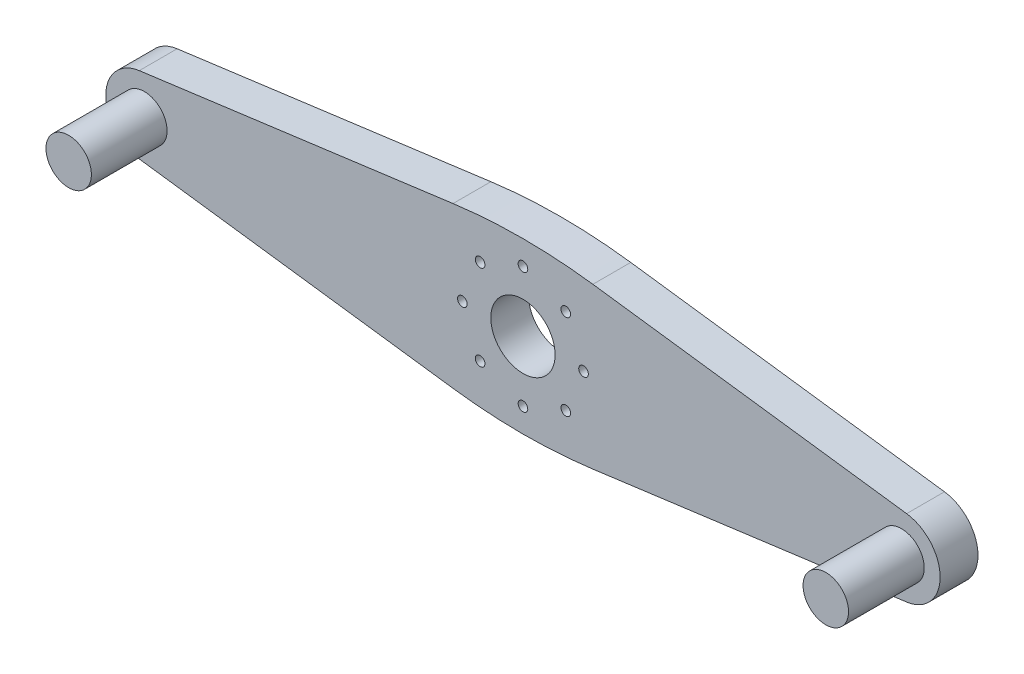
ISO-10303-21;
HEADER;
FILE_DESCRIPTION(('STEP AP214'),'2;1');
FILE_NAME('part.step','',(''),(''),'','','');
FILE_SCHEMA(('AUTOMOTIVE_DESIGN { 1 0 10303 214 1 1 1 1 }'));
ENDSEC;
DATA;
#1=APPLICATION_CONTEXT('core data for automotive mechanical design processes');
#2=APPLICATION_PROTOCOL_DEFINITION('international standard','automotive_design',2000,#1);
#3=PRODUCT_CONTEXT('',#1,'mechanical');
#4=PRODUCT('Part','Part','',(#3));
#5=PRODUCT_RELATED_PRODUCT_CATEGORY('part','',(#4));
#6=PRODUCT_DEFINITION_FORMATION('','',#4);
#7=PRODUCT_DEFINITION_CONTEXT('part definition',#1,'design');
#8=PRODUCT_DEFINITION('design','',#6,#7);
#9=PRODUCT_DEFINITION_SHAPE('','',#8);
#10=(LENGTH_UNIT() NAMED_UNIT(*) SI_UNIT(.MILLI.,.METRE.));
#11=(NAMED_UNIT(*) PLANE_ANGLE_UNIT() SI_UNIT($,.RADIAN.));
#12=(NAMED_UNIT(*) SI_UNIT($,.STERADIAN.) SOLID_ANGLE_UNIT());
#13=UNCERTAINTY_MEASURE_WITH_UNIT(LENGTH_MEASURE(1.E-05),#10,'distance_accuracy_value','');
#14=(GEOMETRIC_REPRESENTATION_CONTEXT(3) GLOBAL_UNCERTAINTY_ASSIGNED_CONTEXT((#13)) GLOBAL_UNIT_ASSIGNED_CONTEXT((#10,
#11,#12)) REPRESENTATION_CONTEXT('',''));
#15=CARTESIAN_POINT('',(0.,0.,0.));
#16=DIRECTION('',(0.,0.,1.));
#17=DIRECTION('',(1.,0.,0.));
#18=AXIS2_PLACEMENT_3D('',#15,#16,#17);
#19=CARTESIAN_POINT('',(50.,0.,5.));
#20=DIRECTION('',(0.,0.,-1.));
#21=DIRECTION('',(-1.,0.,0.));
#22=AXIS2_PLACEMENT_3D('',#19,#20,#21);
#23=PLANE('',#22);
#24=CARTESIAN_POINT('',(50.,0.,5.));
#25=DIRECTION('',(0.,0.,1.));
#26=DIRECTION('',(-1.,0.,0.));
#27=AXIS2_PLACEMENT_3D('',#24,#25,#26);
#28=CIRCLE('',#27,5.10024633771241);
#29=CARTESIAN_POINT('',(50.6728763500851,-5.05566515137672,5.));
#30=VERTEX_POINT('',#29);
#31=CARTESIAN_POINT('',(50.6728763500851,5.05566515137672,5.));
#32=VERTEX_POINT('',#31);
#33=EDGE_CURVE('E144',#30,#32,#28,.T.);
#34=ORIENTED_EDGE('',*,*,#33,.T.);
#35=DIRECTION('',(-0.991259013117456,0.131930166805804,0.));
#36=VECTOR('',#35,1.);
#37=CARTESIAN_POINT('',(50.6728763500851,5.05566515137672,5.));
#38=LINE('',#37,#36);
#39=CARTESIAN_POINT('',(9.2351116764065,10.5707637614413,5.));
#40=VERTEX_POINT('',#39);
#41=EDGE_CURVE('E92',#32,#40,#38,.T.);
#42=ORIENTED_EDGE('',*,*,#41,.T.);
#43=CARTESIAN_POINT('',(0.,-58.8173671567806,5.));
#44=DIRECTION('',(0.,0.,1.));
#45=DIRECTION('',(-1.,0.,0.));
#46=AXIS2_PLACEMENT_3D('',#43,#44,#45);
#47=CIRCLE('',#46,70.);
#48=CARTESIAN_POINT('',(-9.23511167640649,10.5707637614413,5.));
#49=VERTEX_POINT('',#48);
#50=EDGE_CURVE('E159',#40,#49,#47,.T.);
#51=ORIENTED_EDGE('',*,*,#50,.T.);
#52=DIRECTION('',(-0.991259013117456,-0.131930166805804,0.));
#53=VECTOR('',#52,1.);
#54=CARTESIAN_POINT('',(-50.6728763500851,5.05566515137672,5.));
#55=LINE('',#54,#53);
#56=CARTESIAN_POINT('',(-50.6728763500851,5.05566515137672,5.));
#57=VERTEX_POINT('',#56);
#58=EDGE_CURVE('E172',#49,#57,#55,.T.);
#59=ORIENTED_EDGE('',*,*,#58,.T.);
#60=CARTESIAN_POINT('',(-50.,0.,5.));
#61=DIRECTION('',(0.,0.,1.));
#62=DIRECTION('',(1.,0.,0.));
#63=AXIS2_PLACEMENT_3D('',#60,#61,#62);
#64=CIRCLE('',#63,5.10024633771241);
#65=CARTESIAN_POINT('',(-50.6728763500851,-5.05566515137672,5.));
#66=VERTEX_POINT('',#65);
#67=EDGE_CURVE('E111',#57,#66,#64,.T.);
#68=ORIENTED_EDGE('',*,*,#67,.T.);
#69=DIRECTION('',(0.991259013117456,-0.131930166805804,0.));
#70=VECTOR('',#69,1.);
#71=CARTESIAN_POINT('',(-50.6728763500851,-5.05566515137672,5.));
#72=LINE('',#71,#70);
#73=CARTESIAN_POINT('',(-9.23511167640653,-10.5707637614413,5.));
#74=VERTEX_POINT('',#73);
#75=EDGE_CURVE('E105',#66,#74,#72,.T.);
#76=ORIENTED_EDGE('',*,*,#75,.T.);
#77=CARTESIAN_POINT('',(0.,58.8173671567806,5.));
#78=DIRECTION('',(0.,0.,1.));
#79=DIRECTION('',(1.,0.,0.));
#80=AXIS2_PLACEMENT_3D('',#77,#78,#79);
#81=CIRCLE('',#80,70.);
#82=CARTESIAN_POINT('',(9.23511167640649,-10.5707637614413,5.));
#83=VERTEX_POINT('',#82);
#84=EDGE_CURVE('E109',#74,#83,#81,.T.);
#85=ORIENTED_EDGE('',*,*,#84,.T.);
#86=DIRECTION('',(0.991259013117456,0.131930166805804,0.));
#87=VECTOR('',#86,1.);
#88=CARTESIAN_POINT('',(50.6728763500851,-5.05566515137672,5.));
#89=LINE('',#88,#87);
#90=EDGE_CURVE('E49',#83,#30,#89,.T.);
#91=ORIENTED_EDGE('',*,*,#90,.T.);
#92=EDGE_LOOP('',(#34,#42,#51,#59,#68,#76,#85,#91));
#93=FACE_BOUND('',#92,.T.);
#94=CARTESIAN_POINT('',(0.,0.,5.));
#95=DIRECTION('',(0.,0.,1.));
#96=DIRECTION('',(1.,0.,0.));
#97=AXIS2_PLACEMENT_3D('',#94,#95,#96);
#98=CIRCLE('',#97,4.25);
#99=CARTESIAN_POINT('',(4.25,0.,5.));
#100=VERTEX_POINT('',#99);
#101=EDGE_CURVE('E133',#100,#100,#98,.T.);
#102=ORIENTED_EDGE('',*,*,#101,.F.);
#103=EDGE_LOOP('',(#102));
#104=FACE_BOUND('',#103,.T.);
#105=CARTESIAN_POINT('',(-8.,0.,5.));
#106=DIRECTION('',(0.,0.,1.));
#107=DIRECTION('',(1.,0.,0.));
#108=AXIS2_PLACEMENT_3D('',#105,#106,#107);
#109=CIRCLE('',#108,0.635000000000001);
#110=CARTESIAN_POINT('',(-7.365,0.,5.));
#111=VERTEX_POINT('',#110);
#112=EDGE_CURVE('E181',#111,#111,#109,.T.);
#113=ORIENTED_EDGE('',*,*,#112,.F.);
#114=EDGE_LOOP('',(#113));
#115=FACE_BOUND('',#114,.T.);
#116=CARTESIAN_POINT('',(-50.,0.,5.));
#117=DIRECTION('',(0.,0.,1.));
#118=DIRECTION('',(1.,0.,0.));
#119=AXIS2_PLACEMENT_3D('',#116,#117,#118);
#120=CIRCLE('',#119,3.);
#121=CARTESIAN_POINT('',(-47.,0.,5.));
#122=VERTEX_POINT('',#121);
#123=EDGE_CURVE('E187',#122,#122,#120,.T.);
#124=ORIENTED_EDGE('',*,*,#123,.F.);
#125=EDGE_LOOP('',(#124));
#126=FACE_BOUND('',#125,.T.);
#127=CARTESIAN_POINT('',(-5.65685424949237,5.65685424949239,5.));
#128=DIRECTION('',(0.,0.,1.));
#129=DIRECTION('',(1.,0.,0.));
#130=AXIS2_PLACEMENT_3D('',#127,#128,#129);
#131=CIRCLE('',#130,0.635000000000001);
#132=CARTESIAN_POINT('',(-5.02185424949237,5.65685424949239,5.));
#133=VERTEX_POINT('',#132);
#134=EDGE_CURVE('E192',#133,#133,#131,.T.);
#135=ORIENTED_EDGE('',*,*,#134,.F.);
#136=EDGE_LOOP('',(#135));
#137=FACE_BOUND('',#136,.T.);
#138=CARTESIAN_POINT('',(0.,8.,5.));
#139=DIRECTION('',(0.,0.,1.));
#140=DIRECTION('',(1.,0.,0.));
#141=AXIS2_PLACEMENT_3D('',#138,#139,#140);
#142=CIRCLE('',#141,0.635000000000001);
#143=CARTESIAN_POINT('',(0.63500000000003,8.,5.));
#144=VERTEX_POINT('',#143);
#145=EDGE_CURVE('E196',#144,#144,#142,.T.);
#146=ORIENTED_EDGE('',*,*,#145,.F.);
#147=EDGE_LOOP('',(#146));
#148=FACE_BOUND('',#147,.T.);
#149=CARTESIAN_POINT('',(50.,0.,5.));
#150=DIRECTION('',(0.,0.,1.));
#151=DIRECTION('',(-1.,0.,0.));
#152=AXIS2_PLACEMENT_3D('',#149,#150,#151);
#153=CIRCLE('',#152,3.);
#154=CARTESIAN_POINT('',(47.,0.,5.));
#155=VERTEX_POINT('',#154);
#156=EDGE_CURVE('E202',#155,#155,#153,.T.);
#157=ORIENTED_EDGE('',*,*,#156,.F.);
#158=EDGE_LOOP('',(#157));
#159=FACE_BOUND('',#158,.T.);
#160=CARTESIAN_POINT('',(5.65685424949241,5.65685424949235,5.));
#161=DIRECTION('',(0.,0.,1.));
#162=DIRECTION('',(1.,0.,0.));
#163=AXIS2_PLACEMENT_3D('',#160,#161,#162);
#164=CIRCLE('',#163,0.635);
#165=CARTESIAN_POINT('',(6.29185424949241,5.65685424949235,5.));
#166=VERTEX_POINT('',#165);
#167=EDGE_CURVE('E207',#166,#166,#164,.T.);
#168=ORIENTED_EDGE('',*,*,#167,.F.);
#169=EDGE_LOOP('',(#168));
#170=FACE_BOUND('',#169,.T.);
#171=CARTESIAN_POINT('',(8.,0.,5.));
#172=DIRECTION('',(0.,0.,1.));
#173=DIRECTION('',(1.,0.,0.));
#174=AXIS2_PLACEMENT_3D('',#171,#172,#173);
#175=CIRCLE('',#174,0.635);
#176=CARTESIAN_POINT('',(8.635,0.,5.));
#177=VERTEX_POINT('',#176);
#178=EDGE_CURVE('E211',#177,#177,#175,.T.);
#179=ORIENTED_EDGE('',*,*,#178,.F.);
#180=EDGE_LOOP('',(#179));
#181=FACE_BOUND('',#180,.T.);
#182=CARTESIAN_POINT('',(5.65685424949233,-5.65685424949243,5.));
#183=DIRECTION('',(0.,0.,1.));
#184=DIRECTION('',(1.,0.,0.));
#185=AXIS2_PLACEMENT_3D('',#182,#183,#184);
#186=CIRCLE('',#185,0.635000000000001);
#187=CARTESIAN_POINT('',(6.29185424949233,-5.65685424949243,5.));
#188=VERTEX_POINT('',#187);
#189=EDGE_CURVE('E217',#188,#188,#186,.T.);
#190=ORIENTED_EDGE('',*,*,#189,.F.);
#191=EDGE_LOOP('',(#190));
#192=FACE_BOUND('',#191,.T.);
#193=CARTESIAN_POINT('',(0.,-8.,5.));
#194=DIRECTION('',(0.,0.,1.));
#195=DIRECTION('',(1.,0.,0.));
#196=AXIS2_PLACEMENT_3D('',#193,#194,#195);
#197=CIRCLE('',#196,0.635);
#198=CARTESIAN_POINT('',(0.634999999999915,-8.,5.));
#199=VERTEX_POINT('',#198);
#200=EDGE_CURVE('E223',#199,#199,#197,.T.);
#201=ORIENTED_EDGE('',*,*,#200,.F.);
#202=EDGE_LOOP('',(#201));
#203=FACE_BOUND('',#202,.T.);
#204=CARTESIAN_POINT('',(-5.65685424949245,-5.65685424949231,5.));
#205=DIRECTION('',(0.,0.,1.));
#206=DIRECTION('',(1.,0.,0.));
#207=AXIS2_PLACEMENT_3D('',#204,#205,#206);
#208=CIRCLE('',#207,0.635);
#209=CARTESIAN_POINT('',(-5.02185424949245,-5.65685424949231,5.));
#210=VERTEX_POINT('',#209);
#211=EDGE_CURVE('E229',#210,#210,#208,.T.);
#212=ORIENTED_EDGE('',*,*,#211,.F.);
#213=EDGE_LOOP('',(#212));
#214=FACE_BOUND('',#213,.T.);
#215=ADVANCED_FACE('F32',(#93,#104,#115,#126,#137,#148,#159,#170,#181,#192,#203,#214),#23,.F.);
#216=CARTESIAN_POINT('',(50.,0.,0.));
#217=DIRECTION('',(0.,0.,-1.));
#218=DIRECTION('',(-1.,0.,0.));
#219=AXIS2_PLACEMENT_3D('',#216,#217,#218);
#220=PLANE('',#219);
#221=CARTESIAN_POINT('',(0.,-8.,0.));
#222=DIRECTION('',(0.,0.,1.));
#223=DIRECTION('',(1.,0.,0.));
#224=AXIS2_PLACEMENT_3D('',#221,#222,#223);
#225=CIRCLE('',#224,0.635);
#226=CARTESIAN_POINT('',(0.634999999999915,-8.,0.));
#227=VERTEX_POINT('',#226);
#228=EDGE_CURVE('E226',#227,#227,#225,.T.);
#229=ORIENTED_EDGE('',*,*,#228,.T.);
#230=EDGE_LOOP('',(#229));
#231=FACE_BOUND('',#230,.T.);
#232=CARTESIAN_POINT('',(8.,0.,0.));
#233=DIRECTION('',(0.,0.,1.));
#234=DIRECTION('',(1.,0.,0.));
#235=AXIS2_PLACEMENT_3D('',#232,#233,#234);
#236=CIRCLE('',#235,0.635);
#237=CARTESIAN_POINT('',(8.635,0.,0.));
#238=VERTEX_POINT('',#237);
#239=EDGE_CURVE('E214',#238,#238,#236,.T.);
#240=ORIENTED_EDGE('',*,*,#239,.T.);
#241=EDGE_LOOP('',(#240));
#242=FACE_BOUND('',#241,.T.);
#243=CARTESIAN_POINT('',(-5.65685424949237,5.65685424949239,0.));
#244=DIRECTION('',(0.,0.,1.));
#245=DIRECTION('',(1.,0.,0.));
#246=AXIS2_PLACEMENT_3D('',#243,#244,#245);
#247=CIRCLE('',#246,0.635000000000001);
#248=CARTESIAN_POINT('',(-5.02185424949237,5.65685424949239,0.));
#249=VERTEX_POINT('',#248);
#250=EDGE_CURVE('E193',#249,#249,#247,.T.);
#251=ORIENTED_EDGE('',*,*,#250,.T.);
#252=EDGE_LOOP('',(#251));
#253=FACE_BOUND('',#252,.T.);
#254=CARTESIAN_POINT('',(-8.,0.,0.));
#255=DIRECTION('',(0.,0.,1.));
#256=DIRECTION('',(1.,0.,0.));
#257=AXIS2_PLACEMENT_3D('',#254,#255,#256);
#258=CIRCLE('',#257,0.635000000000001);
#259=CARTESIAN_POINT('',(-7.365,0.,0.));
#260=VERTEX_POINT('',#259);
#261=EDGE_CURVE('E184',#260,#260,#258,.T.);
#262=ORIENTED_EDGE('',*,*,#261,.T.);
#263=EDGE_LOOP('',(#262));
#264=FACE_BOUND('',#263,.T.);
#265=CARTESIAN_POINT('',(50.,0.,0.));
#266=DIRECTION('',(0.,0.,1.));
#267=DIRECTION('',(-1.,0.,0.));
#268=AXIS2_PLACEMENT_3D('',#265,#266,#267);
#269=CIRCLE('',#268,5.10024633771241);
#270=CARTESIAN_POINT('',(50.6728763500851,-5.05566515137672,0.));
#271=VERTEX_POINT('',#270);
#272=CARTESIAN_POINT('',(50.6728763500851,5.05566515137672,0.));
#273=VERTEX_POINT('',#272);
#274=EDGE_CURVE('E129',#271,#273,#269,.T.);
#275=ORIENTED_EDGE('',*,*,#274,.F.);
#276=DIRECTION('',(0.991259013117456,0.131930166805804,0.));
#277=VECTOR('',#276,1.);
#278=CARTESIAN_POINT('',(50.6728763500851,-5.05566515137672,0.));
#279=LINE('',#278,#277);
#280=CARTESIAN_POINT('',(9.23511167640649,-10.5707637614413,0.));
#281=VERTEX_POINT('',#280);
#282=EDGE_CURVE('E84',#281,#271,#279,.T.);
#283=ORIENTED_EDGE('',*,*,#282,.F.);
#284=CARTESIAN_POINT('',(0.,58.8173671567806,0.));
#285=DIRECTION('',(0.,0.,1.));
#286=DIRECTION('',(1.,0.,0.));
#287=AXIS2_PLACEMENT_3D('',#284,#285,#286);
#288=CIRCLE('',#287,70.);
#289=CARTESIAN_POINT('',(-9.23511167640653,-10.5707637614413,0.));
#290=VERTEX_POINT('',#289);
#291=EDGE_CURVE('E78',#290,#281,#288,.T.);
#292=ORIENTED_EDGE('',*,*,#291,.F.);
#293=DIRECTION('',(0.991259013117456,-0.131930166805804,0.));
#294=VECTOR('',#293,1.);
#295=CARTESIAN_POINT('',(-50.6728763500851,-5.05566515137672,0.));
#296=LINE('',#295,#294);
#297=CARTESIAN_POINT('',(-50.6728763500851,-5.05566515137672,0.));
#298=VERTEX_POINT('',#297);
#299=EDGE_CURVE('E119',#298,#290,#296,.T.);
#300=ORIENTED_EDGE('',*,*,#299,.F.);
#301=CARTESIAN_POINT('',(-50.,0.,0.));
#302=DIRECTION('',(0.,0.,1.));
#303=DIRECTION('',(1.,0.,0.));
#304=AXIS2_PLACEMENT_3D('',#301,#302,#303);
#305=CIRCLE('',#304,5.10024633771241);
#306=CARTESIAN_POINT('',(-50.6728763500851,5.05566515137672,0.));
#307=VERTEX_POINT('',#306);
#308=EDGE_CURVE('E139',#307,#298,#305,.T.);
#309=ORIENTED_EDGE('',*,*,#308,.F.);
#310=DIRECTION('',(-0.991259013117456,-0.131930166805804,0.));
#311=VECTOR('',#310,1.);
#312=CARTESIAN_POINT('',(-50.6728763500851,5.05566515137672,0.));
#313=LINE('',#312,#311);
#314=CARTESIAN_POINT('',(-9.23511167640649,10.5707637614413,0.));
#315=VERTEX_POINT('',#314);
#316=EDGE_CURVE('E137',#315,#307,#313,.T.);
#317=ORIENTED_EDGE('',*,*,#316,.F.);
#318=CARTESIAN_POINT('',(0.,-58.8173671567806,0.));
#319=DIRECTION('',(0.,0.,1.));
#320=DIRECTION('',(-1.,0.,0.));
#321=AXIS2_PLACEMENT_3D('',#318,#319,#320);
#322=CIRCLE('',#321,70.);
#323=CARTESIAN_POINT('',(9.2351116764065,10.5707637614413,0.));
#324=VERTEX_POINT('',#323);
#325=EDGE_CURVE('E135',#324,#315,#322,.T.);
#326=ORIENTED_EDGE('',*,*,#325,.F.);
#327=DIRECTION('',(-0.991259013117456,0.131930166805804,0.));
#328=VECTOR('',#327,1.);
#329=CARTESIAN_POINT('',(50.6728763500851,5.05566515137672,0.));
#330=LINE('',#329,#328);
#331=EDGE_CURVE('E132',#273,#324,#330,.T.);
#332=ORIENTED_EDGE('',*,*,#331,.F.);
#333=EDGE_LOOP('',(#275,#283,#292,#300,#309,#317,#326,#332));
#334=FACE_BOUND('',#333,.T.);
#335=CARTESIAN_POINT('',(0.,0.,0.));
#336=DIRECTION('',(0.,0.,1.));
#337=DIRECTION('',(1.,0.,0.));
#338=AXIS2_PLACEMENT_3D('',#335,#336,#337);
#339=CIRCLE('',#338,4.25);
#340=CARTESIAN_POINT('',(4.25,0.,0.));
#341=VERTEX_POINT('',#340);
#342=EDGE_CURVE('E178',#341,#341,#339,.T.);
#343=ORIENTED_EDGE('',*,*,#342,.T.);
#344=EDGE_LOOP('',(#343));
#345=FACE_BOUND('',#344,.T.);
#346=CARTESIAN_POINT('',(0.,8.,0.));
#347=DIRECTION('',(0.,0.,1.));
#348=DIRECTION('',(1.,0.,0.));
#349=AXIS2_PLACEMENT_3D('',#346,#347,#348);
#350=CIRCLE('',#349,0.635000000000001);
#351=CARTESIAN_POINT('',(0.63500000000003,8.,0.));
#352=VERTEX_POINT('',#351);
#353=EDGE_CURVE('E199',#352,#352,#350,.T.);
#354=ORIENTED_EDGE('',*,*,#353,.T.);
#355=EDGE_LOOP('',(#354));
#356=FACE_BOUND('',#355,.T.);
#357=CARTESIAN_POINT('',(5.65685424949241,5.65685424949235,0.));
#358=DIRECTION('',(0.,0.,1.));
#359=DIRECTION('',(1.,0.,0.));
#360=AXIS2_PLACEMENT_3D('',#357,#358,#359);
#361=CIRCLE('',#360,0.635);
#362=CARTESIAN_POINT('',(6.29185424949241,5.65685424949235,0.));
#363=VERTEX_POINT('',#362);
#364=EDGE_CURVE('E208',#363,#363,#361,.T.);
#365=ORIENTED_EDGE('',*,*,#364,.T.);
#366=EDGE_LOOP('',(#365));
#367=FACE_BOUND('',#366,.T.);
#368=CARTESIAN_POINT('',(5.65685424949233,-5.65685424949243,0.));
#369=DIRECTION('',(0.,0.,1.));
#370=DIRECTION('',(1.,0.,0.));
#371=AXIS2_PLACEMENT_3D('',#368,#369,#370);
#372=CIRCLE('',#371,0.635000000000001);
#373=CARTESIAN_POINT('',(6.29185424949233,-5.65685424949243,0.));
#374=VERTEX_POINT('',#373);
#375=EDGE_CURVE('E220',#374,#374,#372,.T.);
#376=ORIENTED_EDGE('',*,*,#375,.T.);
#377=EDGE_LOOP('',(#376));
#378=FACE_BOUND('',#377,.T.);
#379=CARTESIAN_POINT('',(-5.65685424949245,-5.65685424949231,0.));
#380=DIRECTION('',(0.,0.,1.));
#381=DIRECTION('',(1.,0.,0.));
#382=AXIS2_PLACEMENT_3D('',#379,#380,#381);
#383=CIRCLE('',#382,0.635);
#384=CARTESIAN_POINT('',(-5.02185424949245,-5.65685424949231,0.));
#385=VERTEX_POINT('',#384);
#386=EDGE_CURVE('E232',#385,#385,#383,.T.);
#387=ORIENTED_EDGE('',*,*,#386,.T.);
#388=EDGE_LOOP('',(#387));
#389=FACE_BOUND('',#388,.T.);
#390=ADVANCED_FACE('F163',(#231,#242,#253,#264,#334,#345,#356,#367,#378,#389),#220,.T.);
#391=CARTESIAN_POINT('',(50.,0.,5.));
#392=DIRECTION('',(0.,0.,-1.));
#393=DIRECTION('',(-1.,0.,0.));
#394=AXIS2_PLACEMENT_3D('',#391,#392,#393);
#395=CYLINDRICAL_SURFACE('',#394,5.10024633771241);
#396=ORIENTED_EDGE('',*,*,#274,.T.);
#397=DIRECTION('',(0.,0.,-1.));
#398=VECTOR('',#397,1.);
#399=CARTESIAN_POINT('',(50.6728763500851,5.05566515137672,5.));
#400=LINE('',#399,#398);
#401=EDGE_CURVE('E11',#32,#273,#400,.T.);
#402=ORIENTED_EDGE('',*,*,#401,.F.);
#403=ORIENTED_EDGE('',*,*,#33,.F.);
#404=DIRECTION('',(0.,0.,-1.));
#405=VECTOR('',#404,1.);
#406=CARTESIAN_POINT('',(50.6728763500851,-5.05566515137672,5.));
#407=LINE('',#406,#405);
#408=EDGE_CURVE('E125',#30,#271,#407,.T.);
#409=ORIENTED_EDGE('',*,*,#408,.T.);
#410=EDGE_LOOP('',(#396,#402,#403,#409));
#411=FACE_BOUND('',#410,.T.);
#412=ADVANCED_FACE('F34',(#411),#395,.T.);
#413=CARTESIAN_POINT('',(50.6728763500851,5.05566515137672,5.));
#414=DIRECTION('',(-0.131930166805804,-0.991259013117456,0.));
#415=DIRECTION('',(0.991259013117456,-0.131930166805804,0.));
#416=AXIS2_PLACEMENT_3D('',#413,#414,#415);
#417=PLANE('',#416);
#418=ORIENTED_EDGE('',*,*,#331,.T.);
#419=DIRECTION('',(0.,0.,-1.));
#420=VECTOR('',#419,1.);
#421=CARTESIAN_POINT('',(9.2351116764065,10.5707637614413,5.));
#422=LINE('',#421,#420);
#423=EDGE_CURVE('E41',#40,#324,#422,.T.);
#424=ORIENTED_EDGE('',*,*,#423,.F.);
#425=ORIENTED_EDGE('',*,*,#41,.F.);
#426=ORIENTED_EDGE('',*,*,#401,.T.);
#427=EDGE_LOOP('',(#418,#424,#425,#426));
#428=FACE_BOUND('',#427,.T.);
#429=ADVANCED_FACE('F278',(#428),#417,.F.);
#430=CARTESIAN_POINT('',(0.,-58.8173671567806,5.));
#431=DIRECTION('',(0.,0.,-1.));
#432=DIRECTION('',(-1.,0.,0.));
#433=AXIS2_PLACEMENT_3D('',#430,#431,#432);
#434=CYLINDRICAL_SURFACE('',#433,70.);
#435=ORIENTED_EDGE('',*,*,#325,.T.);
#436=DIRECTION('',(0.,0.,-1.));
#437=VECTOR('',#436,1.);
#438=CARTESIAN_POINT('',(-9.23511167640649,10.5707637614413,5.));
#439=LINE('',#438,#437);
#440=EDGE_CURVE('E151',#49,#315,#439,.T.);
#441=ORIENTED_EDGE('',*,*,#440,.F.);
#442=ORIENTED_EDGE('',*,*,#50,.F.);
#443=ORIENTED_EDGE('',*,*,#423,.T.);
#444=EDGE_LOOP('',(#435,#441,#442,#443));
#445=FACE_BOUND('',#444,.T.);
#446=ADVANCED_FACE('F157',(#445),#434,.T.);
#447=CARTESIAN_POINT('',(-50.6728763500851,5.05566515137672,5.));
#448=DIRECTION('',(0.131930166805804,-0.991259013117456,0.));
#449=DIRECTION('',(0.991259013117456,0.131930166805804,0.));
#450=AXIS2_PLACEMENT_3D('',#447,#448,#449);
#451=PLANE('',#450);
#452=ORIENTED_EDGE('',*,*,#316,.T.);
#453=DIRECTION('',(0.,0.,-1.));
#454=VECTOR('',#453,1.);
#455=CARTESIAN_POINT('',(-50.6728763500851,5.05566515137672,5.));
#456=LINE('',#455,#454);
#457=EDGE_CURVE('E148',#57,#307,#456,.T.);
#458=ORIENTED_EDGE('',*,*,#457,.F.);
#459=ORIENTED_EDGE('',*,*,#58,.F.);
#460=ORIENTED_EDGE('',*,*,#440,.T.);
#461=EDGE_LOOP('',(#452,#458,#459,#460));
#462=FACE_BOUND('',#461,.T.);
#463=ADVANCED_FACE('F168',(#462),#451,.F.);
#464=CARTESIAN_POINT('',(-50.,0.,5.));
#465=DIRECTION('',(0.,0.,-1.));
#466=DIRECTION('',(-1.,0.,0.));
#467=AXIS2_PLACEMENT_3D('',#464,#465,#466);
#468=CYLINDRICAL_SURFACE('',#467,5.10024633771241);
#469=ORIENTED_EDGE('',*,*,#308,.T.);
#470=DIRECTION('',(0.,0.,-1.));
#471=VECTOR('',#470,1.);
#472=CARTESIAN_POINT('',(-50.6728763500851,-5.05566515137672,5.));
#473=LINE('',#472,#471);
#474=EDGE_CURVE('E120',#66,#298,#473,.T.);
#475=ORIENTED_EDGE('',*,*,#474,.F.);
#476=ORIENTED_EDGE('',*,*,#67,.F.);
#477=ORIENTED_EDGE('',*,*,#457,.T.);
#478=EDGE_LOOP('',(#469,#475,#476,#477));
#479=FACE_BOUND('',#478,.T.);
#480=ADVANCED_FACE('F171',(#479),#468,.T.);
#481=CARTESIAN_POINT('',(-50.6728763500851,-5.05566515137672,5.));
#482=DIRECTION('',(0.131930166805804,0.991259013117456,0.));
#483=DIRECTION('',(-0.991259013117456,0.131930166805804,0.));
#484=AXIS2_PLACEMENT_3D('',#481,#482,#483);
#485=PLANE('',#484);
#486=ORIENTED_EDGE('',*,*,#299,.T.);
#487=DIRECTION('',(0.,0.,-1.));
#488=VECTOR('',#487,1.);
#489=CARTESIAN_POINT('',(-9.23511167640653,-10.5707637614413,5.));
#490=LINE('',#489,#488);
#491=EDGE_CURVE('E116',#74,#290,#490,.T.);
#492=ORIENTED_EDGE('',*,*,#491,.F.);
#493=ORIENTED_EDGE('',*,*,#75,.F.);
#494=ORIENTED_EDGE('',*,*,#474,.T.);
#495=EDGE_LOOP('',(#486,#492,#493,#494));
#496=FACE_BOUND('',#495,.T.);
#497=ADVANCED_FACE('F117',(#496),#485,.F.);
#498=CARTESIAN_POINT('',(0.,58.8173671567806,5.));
#499=DIRECTION('',(0.,0.,-1.));
#500=DIRECTION('',(-1.,0.,0.));
#501=AXIS2_PLACEMENT_3D('',#498,#499,#500);
#502=CYLINDRICAL_SURFACE('',#501,70.);
#503=ORIENTED_EDGE('',*,*,#291,.T.);
#504=DIRECTION('',(0.,0.,-1.));
#505=VECTOR('',#504,1.);
#506=CARTESIAN_POINT('',(9.23511167640649,-10.5707637614413,5.));
#507=LINE('',#506,#505);
#508=EDGE_CURVE('E121',#83,#281,#507,.T.);
#509=ORIENTED_EDGE('',*,*,#508,.F.);
#510=ORIENTED_EDGE('',*,*,#84,.F.);
#511=ORIENTED_EDGE('',*,*,#491,.T.);
#512=EDGE_LOOP('',(#503,#509,#510,#511));
#513=FACE_BOUND('',#512,.T.);
#514=ADVANCED_FACE('F123',(#513),#502,.T.);
#515=CARTESIAN_POINT('',(50.6728763500851,-5.05566515137672,5.));
#516=DIRECTION('',(-0.131930166805804,0.991259013117456,0.));
#517=DIRECTION('',(-0.991259013117456,-0.131930166805804,0.));
#518=AXIS2_PLACEMENT_3D('',#515,#516,#517);
#519=PLANE('',#518);
#520=ORIENTED_EDGE('',*,*,#282,.T.);
#521=ORIENTED_EDGE('',*,*,#408,.F.);
#522=ORIENTED_EDGE('',*,*,#90,.F.);
#523=ORIENTED_EDGE('',*,*,#508,.T.);
#524=EDGE_LOOP('',(#520,#521,#522,#523));
#525=FACE_BOUND('',#524,.T.);
#526=ADVANCED_FACE('F266',(#525),#519,.F.);
#527=CARTESIAN_POINT('',(0.,0.,5.));
#528=DIRECTION('',(0.,0.,-1.));
#529=DIRECTION('',(-1.,0.,0.));
#530=AXIS2_PLACEMENT_3D('',#527,#528,#529);
#531=CYLINDRICAL_SURFACE('',#530,4.25);
#532=ORIENTED_EDGE('',*,*,#101,.T.);
#533=EDGE_LOOP('',(#532));
#534=FACE_BOUND('',#533,.T.);
#535=ORIENTED_EDGE('',*,*,#342,.F.);
#536=EDGE_LOOP('',(#535));
#537=FACE_BOUND('',#536,.T.);
#538=ADVANCED_FACE('F263',(#534,#537),#531,.F.);
#539=CARTESIAN_POINT('',(-8.,0.,5.));
#540=DIRECTION('',(0.,0.,-1.));
#541=DIRECTION('',(-1.,0.,0.));
#542=AXIS2_PLACEMENT_3D('',#539,#540,#541);
#543=CYLINDRICAL_SURFACE('',#542,0.635000000000001);
#544=ORIENTED_EDGE('',*,*,#112,.T.);
#545=EDGE_LOOP('',(#544));
#546=FACE_BOUND('',#545,.T.);
#547=ORIENTED_EDGE('',*,*,#261,.F.);
#548=EDGE_LOOP('',(#547));
#549=FACE_BOUND('',#548,.T.);
#550=ADVANCED_FACE('F357',(#546,#549),#543,.F.);
#551=CARTESIAN_POINT('',(-5.65685424949237,5.65685424949239,5.));
#552=DIRECTION('',(0.,0.,-1.));
#553=DIRECTION('',(-1.,0.,0.));
#554=AXIS2_PLACEMENT_3D('',#551,#552,#553);
#555=CYLINDRICAL_SURFACE('',#554,0.635000000000001);
#556=ORIENTED_EDGE('',*,*,#134,.T.);
#557=EDGE_LOOP('',(#556));
#558=FACE_BOUND('',#557,.T.);
#559=ORIENTED_EDGE('',*,*,#250,.F.);
#560=EDGE_LOOP('',(#559));
#561=FACE_BOUND('',#560,.T.);
#562=ADVANCED_FACE('F354',(#558,#561),#555,.F.);
#563=CARTESIAN_POINT('',(0.,8.,5.));
#564=DIRECTION('',(0.,0.,-1.));
#565=DIRECTION('',(-1.,0.,0.));
#566=AXIS2_PLACEMENT_3D('',#563,#564,#565);
#567=CYLINDRICAL_SURFACE('',#566,0.635000000000001);
#568=ORIENTED_EDGE('',*,*,#145,.T.);
#569=EDGE_LOOP('',(#568));
#570=FACE_BOUND('',#569,.T.);
#571=ORIENTED_EDGE('',*,*,#353,.F.);
#572=EDGE_LOOP('',(#571));
#573=FACE_BOUND('',#572,.T.);
#574=ADVANCED_FACE('F350',(#570,#573),#567,.F.);
#575=CARTESIAN_POINT('',(5.65685424949241,5.65685424949235,5.));
#576=DIRECTION('',(0.,0.,-1.));
#577=DIRECTION('',(-1.,0.,0.));
#578=AXIS2_PLACEMENT_3D('',#575,#576,#577);
#579=CYLINDRICAL_SURFACE('',#578,0.635);
#580=ORIENTED_EDGE('',*,*,#167,.T.);
#581=EDGE_LOOP('',(#580));
#582=FACE_BOUND('',#581,.T.);
#583=ORIENTED_EDGE('',*,*,#364,.F.);
#584=EDGE_LOOP('',(#583));
#585=FACE_BOUND('',#584,.T.);
#586=ADVANCED_FACE('F346',(#582,#585),#579,.F.);
#587=CARTESIAN_POINT('',(8.,0.,5.));
#588=DIRECTION('',(0.,0.,-1.));
#589=DIRECTION('',(-1.,0.,0.));
#590=AXIS2_PLACEMENT_3D('',#587,#588,#589);
#591=CYLINDRICAL_SURFACE('',#590,0.635);
#592=ORIENTED_EDGE('',*,*,#178,.T.);
#593=EDGE_LOOP('',(#592));
#594=FACE_BOUND('',#593,.T.);
#595=ORIENTED_EDGE('',*,*,#239,.F.);
#596=EDGE_LOOP('',(#595));
#597=FACE_BOUND('',#596,.T.);
#598=ADVANCED_FACE('F342',(#594,#597),#591,.F.);
#599=CARTESIAN_POINT('',(5.65685424949233,-5.65685424949243,5.));
#600=DIRECTION('',(0.,0.,-1.));
#601=DIRECTION('',(-1.,0.,0.));
#602=AXIS2_PLACEMENT_3D('',#599,#600,#601);
#603=CYLINDRICAL_SURFACE('',#602,0.635000000000001);
#604=ORIENTED_EDGE('',*,*,#189,.T.);
#605=EDGE_LOOP('',(#604));
#606=FACE_BOUND('',#605,.T.);
#607=ORIENTED_EDGE('',*,*,#375,.F.);
#608=EDGE_LOOP('',(#607));
#609=FACE_BOUND('',#608,.T.);
#610=ADVANCED_FACE('F338',(#606,#609),#603,.F.);
#611=CARTESIAN_POINT('',(0.,-8.,5.));
#612=DIRECTION('',(0.,0.,-1.));
#613=DIRECTION('',(-1.,0.,0.));
#614=AXIS2_PLACEMENT_3D('',#611,#612,#613);
#615=CYLINDRICAL_SURFACE('',#614,0.635);
#616=ORIENTED_EDGE('',*,*,#200,.T.);
#617=EDGE_LOOP('',(#616));
#618=FACE_BOUND('',#617,.T.);
#619=ORIENTED_EDGE('',*,*,#228,.F.);
#620=EDGE_LOOP('',(#619));
#621=FACE_BOUND('',#620,.T.);
#622=ADVANCED_FACE('F334',(#618,#621),#615,.F.);
#623=CARTESIAN_POINT('',(-5.65685424949245,-5.65685424949231,5.));
#624=DIRECTION('',(0.,0.,-1.));
#625=DIRECTION('',(-1.,0.,0.));
#626=AXIS2_PLACEMENT_3D('',#623,#624,#625);
#627=CYLINDRICAL_SURFACE('',#626,0.635);
#628=ORIENTED_EDGE('',*,*,#211,.T.);
#629=EDGE_LOOP('',(#628));
#630=FACE_BOUND('',#629,.T.);
#631=ORIENTED_EDGE('',*,*,#386,.F.);
#632=EDGE_LOOP('',(#631));
#633=FACE_BOUND('',#632,.T.);
#634=ADVANCED_FACE('F300',(#630,#633),#627,.F.);
#635=CARTESIAN_POINT('',(-50.,0.,15.));
#636=DIRECTION('',(0.,0.,-1.));
#637=DIRECTION('',(-1.,0.,0.));
#638=AXIS2_PLACEMENT_3D('',#635,#636,#637);
#639=CYLINDRICAL_SURFACE('',#638,3.);
#640=CARTESIAN_POINT('',(-50.,0.,15.));
#641=DIRECTION('',(0.,0.,1.));
#642=DIRECTION('',(1.,0.,0.));
#643=AXIS2_PLACEMENT_3D('',#640,#641,#642);
#644=CIRCLE('',#643,3.);
#645=CARTESIAN_POINT('',(-47.,0.,15.));
#646=VERTEX_POINT('',#645);
#647=EDGE_CURVE('E235',#646,#646,#644,.T.);
#648=ORIENTED_EDGE('',*,*,#647,.F.);
#649=EDGE_LOOP('',(#648));
#650=FACE_BOUND('',#649,.T.);
#651=ORIENTED_EDGE('',*,*,#123,.T.);
#652=EDGE_LOOP('',(#651));
#653=FACE_BOUND('',#652,.T.);
#654=ADVANCED_FACE('F305',(#650,#653),#639,.T.);
#655=CARTESIAN_POINT('',(0.,0.,15.));
#656=DIRECTION('',(0.,0.,1.));
#657=DIRECTION('',(1.,0.,0.));
#658=AXIS2_PLACEMENT_3D('',#655,#656,#657);
#659=PLANE('',#658);
#660=ORIENTED_EDGE('',*,*,#647,.T.);
#661=EDGE_LOOP('',(#660));
#662=FACE_BOUND('',#661,.T.);
#663=ADVANCED_FACE('F253',(#662),#659,.T.);
#664=CARTESIAN_POINT('',(50.,0.,15.));
#665=DIRECTION('',(0.,0.,-1.));
#666=DIRECTION('',(-1.,0.,0.));
#667=AXIS2_PLACEMENT_3D('',#664,#665,#666);
#668=CYLINDRICAL_SURFACE('',#667,3.);
#669=CARTESIAN_POINT('',(50.,0.,15.));
#670=DIRECTION('',(0.,0.,1.));
#671=DIRECTION('',(1.,0.,0.));
#672=AXIS2_PLACEMENT_3D('',#669,#670,#671);
#673=CIRCLE('',#672,3.);
#674=CARTESIAN_POINT('',(53.,0.,15.));
#675=VERTEX_POINT('',#674);
#676=EDGE_CURVE('E240',#675,#675,#673,.F.);
#677=ORIENTED_EDGE('',*,*,#676,.T.);
#678=EDGE_LOOP('',(#677));
#679=FACE_BOUND('',#678,.T.);
#680=ORIENTED_EDGE('',*,*,#156,.T.);
#681=EDGE_LOOP('',(#680));
#682=FACE_BOUND('',#681,.T.);
#683=ADVANCED_FACE('F244',(#679,#682),#668,.T.);
#684=CARTESIAN_POINT('',(0.,0.,15.));
#685=DIRECTION('',(0.,0.,1.));
#686=DIRECTION('',(1.,0.,0.));
#687=AXIS2_PLACEMENT_3D('',#684,#685,#686);
#688=PLANE('',#687);
#689=ORIENTED_EDGE('',*,*,#676,.F.);
#690=EDGE_LOOP('',(#689));
#691=FACE_BOUND('',#690,.T.);
#692=ADVANCED_FACE('F247',(#691),#688,.T.);
#693=CLOSED_SHELL('',(#215,#390,#412,#429,#446,#463,#480,#497,#514,#526,#538,#550,#562,#574,
#586,#598,#610,#622,#634,#654,#663,#683,#692));
#694=MANIFOLD_SOLID_BREP('B2',#693);
#695=ADVANCED_BREP_SHAPE_REPRESENTATION('',(#18,#694),#14);
#696=SHAPE_DEFINITION_REPRESENTATION(#9,#695);
ENDSEC;
END-ISO-10303-21;
